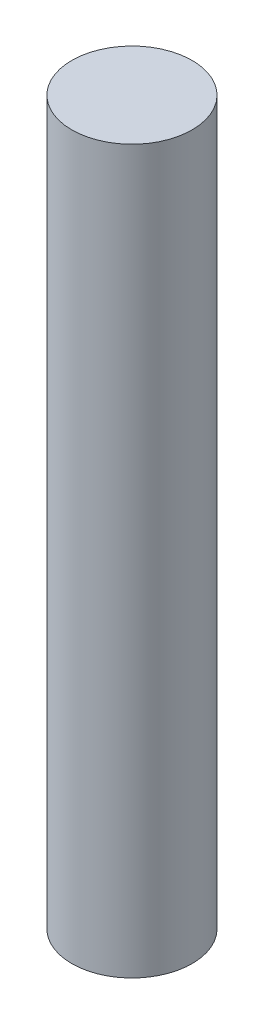
ISO-10303-21;
HEADER;
FILE_DESCRIPTION(('STEP AP214'),'2;1');
FILE_NAME('part.step','',(''),(''),'','','');
FILE_SCHEMA(('AUTOMOTIVE_DESIGN { 1 0 10303 214 1 1 1 1 }'));
ENDSEC;
DATA;
#1=APPLICATION_CONTEXT('core data for automotive mechanical design processes');
#2=APPLICATION_PROTOCOL_DEFINITION('international standard','automotive_design',2000,#1);
#3=PRODUCT_CONTEXT('',#1,'mechanical');
#4=PRODUCT('Part','Part','',(#3));
#5=PRODUCT_RELATED_PRODUCT_CATEGORY('part','',(#4));
#6=PRODUCT_DEFINITION_FORMATION('','',#4);
#7=PRODUCT_DEFINITION_CONTEXT('part definition',#1,'design');
#8=PRODUCT_DEFINITION('design','',#6,#7);
#9=PRODUCT_DEFINITION_SHAPE('','',#8);
#10=(LENGTH_UNIT() NAMED_UNIT(*) SI_UNIT(.MILLI.,.METRE.));
#11=(NAMED_UNIT(*) PLANE_ANGLE_UNIT() SI_UNIT($,.RADIAN.));
#12=(NAMED_UNIT(*) SI_UNIT($,.STERADIAN.) SOLID_ANGLE_UNIT());
#13=UNCERTAINTY_MEASURE_WITH_UNIT(LENGTH_MEASURE(1.E-05),#10,'distance_accuracy_value','');
#14=(GEOMETRIC_REPRESENTATION_CONTEXT(3) GLOBAL_UNCERTAINTY_ASSIGNED_CONTEXT((#13)) GLOBAL_UNIT_ASSIGNED_CONTEXT((#10,
#11,#12)) REPRESENTATION_CONTEXT('',''));
#15=CARTESIAN_POINT('',(0.,0.,0.));
#16=DIRECTION('',(0.,0.,1.));
#17=DIRECTION('',(1.,0.,0.));
#18=AXIS2_PLACEMENT_3D('',#15,#16,#17);
#19=CARTESIAN_POINT('',(0.,38.1,0.));
#20=DIRECTION('',(0.,-1.,0.));
#21=DIRECTION('',(0.,0.,-1.));
#22=AXIS2_PLACEMENT_3D('',#19,#20,#21);
#23=CYLINDRICAL_SURFACE('',#22,3.175);
#24=CARTESIAN_POINT('',(0.,38.1,0.));
#25=DIRECTION('',(0.,1.,0.));
#26=DIRECTION('',(0.,0.,1.));
#27=AXIS2_PLACEMENT_3D('',#24,#25,#26);
#28=CIRCLE('',#27,3.175);
#29=CARTESIAN_POINT('',(0.,38.1,3.175));
#30=VERTEX_POINT('',#29);
#31=EDGE_CURVE('E10',#30,#30,#28,.T.);
#32=ORIENTED_EDGE('',*,*,#31,.F.);
#33=EDGE_LOOP('',(#32));
#34=FACE_BOUND('',#33,.T.);
#35=CARTESIAN_POINT('',(0.,0.,0.));
#36=DIRECTION('',(0.,1.,0.));
#37=DIRECTION('',(0.,0.,1.));
#38=AXIS2_PLACEMENT_3D('',#35,#36,#37);
#39=CIRCLE('',#38,3.175);
#40=CARTESIAN_POINT('',(0.,0.,3.175));
#41=VERTEX_POINT('',#40);
#42=EDGE_CURVE('E44',#41,#41,#39,.T.);
#43=ORIENTED_EDGE('',*,*,#42,.T.);
#44=EDGE_LOOP('',(#43));
#45=FACE_BOUND('',#44,.T.);
#46=ADVANCED_FACE('F41',(#34,#45),#23,.T.);
#47=CARTESIAN_POINT('',(0.,38.1,0.));
#48=DIRECTION('',(0.,1.,0.));
#49=DIRECTION('',(0.,0.,1.));
#50=AXIS2_PLACEMENT_3D('',#47,#48,#49);
#51=PLANE('',#50);
#52=ORIENTED_EDGE('',*,*,#31,.T.);
#53=EDGE_LOOP('',(#52));
#54=FACE_BOUND('',#53,.T.);
#55=ADVANCED_FACE('F58',(#54),#51,.T.);
#56=CARTESIAN_POINT('',(0.,0.,0.));
#57=DIRECTION('',(0.,1.,0.));
#58=DIRECTION('',(0.,0.,1.));
#59=AXIS2_PLACEMENT_3D('',#56,#57,#58);
#60=PLANE('',#59);
#61=ORIENTED_EDGE('',*,*,#42,.F.);
#62=EDGE_LOOP('',(#61));
#63=FACE_BOUND('',#62,.T.);
#64=ADVANCED_FACE('F56',(#63),#60,.F.);
#65=CLOSED_SHELL('',(#46,#55,#64));
#66=MANIFOLD_SOLID_BREP('B2',#65);
#67=ADVANCED_BREP_SHAPE_REPRESENTATION('',(#18,#66),#14);
#68=SHAPE_DEFINITION_REPRESENTATION(#9,#67);
ENDSEC;
END-ISO-10303-21;
